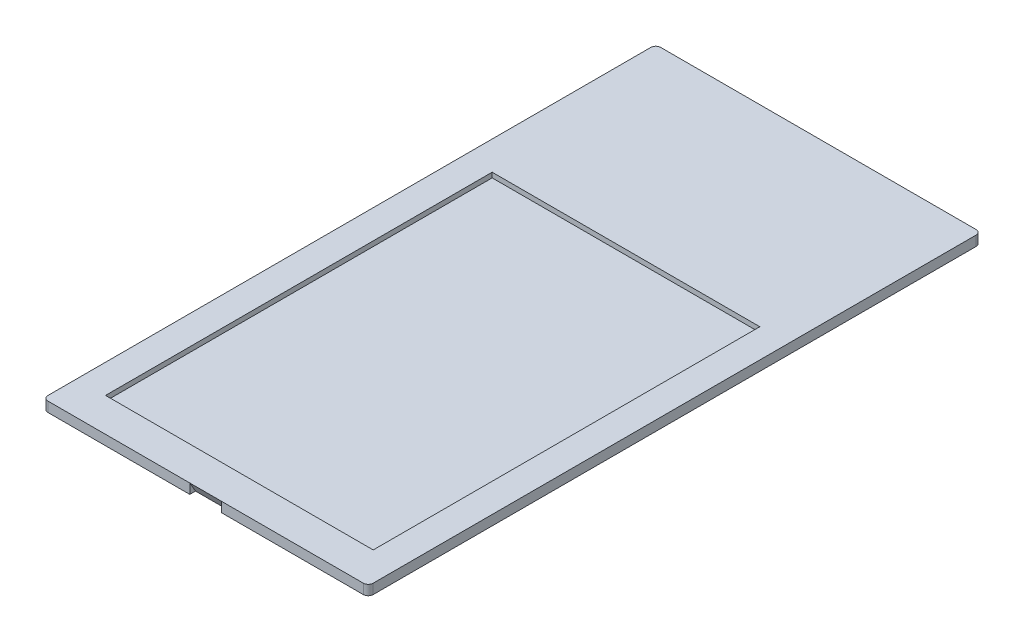
ISO-10303-21;
HEADER;
FILE_DESCRIPTION(('STEP AP214'),'2;1');
FILE_NAME('part.step','',(''),(''),'','','');
FILE_SCHEMA(('AUTOMOTIVE_DESIGN { 1 0 10303 214 1 1 1 1 }'));
ENDSEC;
DATA;
#1=APPLICATION_CONTEXT('core data for automotive mechanical design processes');
#2=APPLICATION_PROTOCOL_DEFINITION('international standard','automotive_design',2000,#1);
#3=PRODUCT_CONTEXT('',#1,'mechanical');
#4=PRODUCT('Part','Part','',(#3));
#5=PRODUCT_RELATED_PRODUCT_CATEGORY('part','',(#4));
#6=PRODUCT_DEFINITION_FORMATION('','',#4);
#7=PRODUCT_DEFINITION_CONTEXT('part definition',#1,'design');
#8=PRODUCT_DEFINITION('design','',#6,#7);
#9=PRODUCT_DEFINITION_SHAPE('','',#8);
#10=(LENGTH_UNIT() NAMED_UNIT(*) SI_UNIT(.MILLI.,.METRE.));
#11=(NAMED_UNIT(*) PLANE_ANGLE_UNIT() SI_UNIT($,.RADIAN.));
#12=(NAMED_UNIT(*) SI_UNIT($,.STERADIAN.) SOLID_ANGLE_UNIT());
#13=UNCERTAINTY_MEASURE_WITH_UNIT(LENGTH_MEASURE(1.E-05),#10,'distance_accuracy_value','');
#14=(GEOMETRIC_REPRESENTATION_CONTEXT(3) GLOBAL_UNCERTAINTY_ASSIGNED_CONTEXT((#13)) GLOBAL_UNIT_ASSIGNED_CONTEXT((#10,
#11,#12)) REPRESENTATION_CONTEXT('',''));
#15=CARTESIAN_POINT('',(0.,0.,0.));
#16=DIRECTION('',(0.,0.,1.));
#17=DIRECTION('',(1.,0.,0.));
#18=AXIS2_PLACEMENT_3D('',#15,#16,#17);
#19=CARTESIAN_POINT('',(0.,-2.,0.));
#20=DIRECTION('',(0.,-1.,0.));
#21=DIRECTION('',(0.,0.,-1.));
#22=AXIS2_PLACEMENT_3D('',#19,#20,#21);
#23=PLANE('',#22);
#24=DIRECTION('',(0.,0.,1.));
#25=VECTOR('',#24,1.);
#26=CARTESIAN_POINT('',(-32.8,-2.,2.19999999999999));
#27=LINE('',#26,#25);
#28=CARTESIAN_POINT('',(-32.8,-2.,3.19999999999999));
#29=VERTEX_POINT('',#28);
#30=CARTESIAN_POINT('',(-32.8,-2.,124.8));
#31=VERTEX_POINT('',#30);
#32=EDGE_CURVE('E268',#29,#31,#27,.T.);
#33=ORIENTED_EDGE('',*,*,#32,.F.);
#34=CARTESIAN_POINT('',(-31.8,-2.,3.19999999999999));
#35=DIRECTION('',(0.,-1.,0.));
#36=DIRECTION('',(0.,0.,-1.));
#37=AXIS2_PLACEMENT_3D('',#34,#35,#36);
#38=CIRCLE('',#37,1.);
#39=CARTESIAN_POINT('',(-31.8,-2.,2.19999999999999));
#40=VERTEX_POINT('',#39);
#41=EDGE_CURVE('E295',#29,#40,#38,.T.);
#42=ORIENTED_EDGE('',*,*,#41,.T.);
#43=DIRECTION('',(-1.,0.,0.));
#44=VECTOR('',#43,1.);
#45=CARTESIAN_POINT('',(-32.8,-2.,2.19999999999999));
#46=LINE('',#45,#44);
#47=CARTESIAN_POINT('',(-3.2,-2.,2.19999999999999));
#48=VERTEX_POINT('',#47);
#49=EDGE_CURVE('E274',#48,#40,#46,.T.);
#50=ORIENTED_EDGE('',*,*,#49,.F.);
#51=DIRECTION('',(0.,0.,-1.));
#52=VECTOR('',#51,1.);
#53=CARTESIAN_POINT('',(-3.2,-2.,2.19999999999999));
#54=LINE('',#53,#52);
#55=CARTESIAN_POINT('',(-3.2,-2.,3.35470053837923));
#56=VERTEX_POINT('',#55);
#57=EDGE_CURVE('E249',#56,#48,#54,.T.);
#58=ORIENTED_EDGE('',*,*,#57,.F.);
#59=DIRECTION('',(1.,0.,0.));
#60=VECTOR('',#59,1.);
#61=CARTESIAN_POINT('',(-3.2,-2.,3.35470053837923));
#62=LINE('',#61,#60);
#63=CARTESIAN_POINT('',(3.2,-2.,3.35470053837923));
#64=VERTEX_POINT('',#63);
#65=EDGE_CURVE('E232',#56,#64,#62,.T.);
#66=ORIENTED_EDGE('',*,*,#65,.T.);
#67=DIRECTION('',(0.,0.,-1.));
#68=VECTOR('',#67,1.);
#69=CARTESIAN_POINT('',(3.2,-2.,2.19999999999999));
#70=LINE('',#69,#68);
#71=CARTESIAN_POINT('',(3.2,-2.,2.19999999999999));
#72=VERTEX_POINT('',#71);
#73=EDGE_CURVE('E241',#64,#72,#70,.T.);
#74=ORIENTED_EDGE('',*,*,#73,.T.);
#75=CARTESIAN_POINT('',(31.8,-2.,2.19999999999999));
#76=VERTEX_POINT('',#75);
#77=EDGE_CURVE('E272',#76,#72,#46,.T.);
#78=ORIENTED_EDGE('',*,*,#77,.F.);
#79=CARTESIAN_POINT('',(31.8,-2.,3.19999999999999));
#80=DIRECTION('',(0.,-1.,0.));
#81=DIRECTION('',(0.,0.,-1.));
#82=AXIS2_PLACEMENT_3D('',#79,#80,#81);
#83=CIRCLE('',#82,1.);
#84=CARTESIAN_POINT('',(32.8,-2.,3.19999999999999));
#85=VERTEX_POINT('',#84);
#86=EDGE_CURVE('E60',#76,#85,#83,.T.);
#87=ORIENTED_EDGE('',*,*,#86,.T.);
#88=DIRECTION('',(0.,0.,-1.));
#89=VECTOR('',#88,1.);
#90=CARTESIAN_POINT('',(32.8,-2.,2.19999999999999));
#91=LINE('',#90,#89);
#92=CARTESIAN_POINT('',(32.8,-2.,124.8));
#93=VERTEX_POINT('',#92);
#94=EDGE_CURVE('E267',#93,#85,#91,.T.);
#95=ORIENTED_EDGE('',*,*,#94,.F.);
#96=CARTESIAN_POINT('',(31.8,-2.,124.8));
#97=DIRECTION('',(0.,-1.,0.));
#98=DIRECTION('',(0.,0.,-1.));
#99=AXIS2_PLACEMENT_3D('',#96,#97,#98);
#100=CIRCLE('',#99,1.);
#101=CARTESIAN_POINT('',(31.8,-2.,125.8));
#102=VERTEX_POINT('',#101);
#103=EDGE_CURVE('E54',#93,#102,#100,.T.);
#104=ORIENTED_EDGE('',*,*,#103,.T.);
#105=DIRECTION('',(1.,0.,0.));
#106=VECTOR('',#105,1.);
#107=CARTESIAN_POINT('',(-32.8,-2.,125.8));
#108=LINE('',#107,#106);
#109=CARTESIAN_POINT('',(3.2,-2.,125.8));
#110=VERTEX_POINT('',#109);
#111=EDGE_CURVE('E255',#110,#102,#108,.T.);
#112=ORIENTED_EDGE('',*,*,#111,.F.);
#113=DIRECTION('',(0.,0.,-1.));
#114=VECTOR('',#113,1.);
#115=CARTESIAN_POINT('',(3.2,-2.,124.645299461621));
#116=LINE('',#115,#114);
#117=CARTESIAN_POINT('',(3.2,-2.,124.645299461621));
#118=VERTEX_POINT('',#117);
#119=EDGE_CURVE('E221',#110,#118,#116,.T.);
#120=ORIENTED_EDGE('',*,*,#119,.T.);
#121=DIRECTION('',(1.,0.,0.));
#122=VECTOR('',#121,1.);
#123=CARTESIAN_POINT('',(-3.2,-2.,124.645299461621));
#124=LINE('',#123,#122);
#125=CARTESIAN_POINT('',(-3.2,-2.,124.645299461621));
#126=VERTEX_POINT('',#125);
#127=EDGE_CURVE('E217',#126,#118,#124,.T.);
#128=ORIENTED_EDGE('',*,*,#127,.F.);
#129=DIRECTION('',(0.,0.,-1.));
#130=VECTOR('',#129,1.);
#131=CARTESIAN_POINT('',(-3.2,-2.,124.645299461621));
#132=LINE('',#131,#130);
#133=CARTESIAN_POINT('',(-3.2,-2.,125.8));
#134=VERTEX_POINT('',#133);
#135=EDGE_CURVE('E211',#134,#126,#132,.T.);
#136=ORIENTED_EDGE('',*,*,#135,.F.);
#137=CARTESIAN_POINT('',(-31.8,-2.,125.8));
#138=VERTEX_POINT('',#137);
#139=EDGE_CURVE('E265',#138,#134,#108,.T.);
#140=ORIENTED_EDGE('',*,*,#139,.F.);
#141=CARTESIAN_POINT('',(-31.8,-2.,124.8));
#142=DIRECTION('',(0.,-1.,0.));
#143=DIRECTION('',(0.,0.,-1.));
#144=AXIS2_PLACEMENT_3D('',#141,#142,#143);
#145=CIRCLE('',#144,1.);
#146=EDGE_CURVE('E293',#138,#31,#145,.T.);
#147=ORIENTED_EDGE('',*,*,#146,.T.);
#148=EDGE_LOOP('',(#33,#42,#50,#58,#66,#74,#78,#87,#95,#104,#112,#120,#128,#136,#140,#147));
#149=FACE_BOUND('',#148,.T.);
#150=ADVANCED_FACE('F39',(#149),#23,.T.);
#151=CARTESIAN_POINT('',(-32.8,-141.929696633702,125.8));
#152=DIRECTION('',(0.,0.,1.));
#153=DIRECTION('',(1.,0.,0.));
#154=AXIS2_PLACEMENT_3D('',#151,#152,#153);
#155=PLANE('',#154);
#156=DIRECTION('',(1.,0.,0.));
#157=VECTOR('',#156,1.);
#158=CARTESIAN_POINT('',(-32.8,0.,125.8));
#159=LINE('',#158,#157);
#160=CARTESIAN_POINT('',(-31.8,0.,125.8));
#161=VERTEX_POINT('',#160);
#162=CARTESIAN_POINT('',(-3.2,0.,125.8));
#163=VERTEX_POINT('',#162);
#164=EDGE_CURVE('E260',#161,#163,#159,.T.);
#165=ORIENTED_EDGE('',*,*,#164,.F.);
#166=DIRECTION('',(0.,1.,0.));
#167=VECTOR('',#166,1.);
#168=CARTESIAN_POINT('',(-31.8,-141.929696633702,125.8));
#169=LINE('',#168,#167);
#170=EDGE_CURVE('E297',#161,#138,#169,.F.);
#171=ORIENTED_EDGE('',*,*,#170,.T.);
#172=ORIENTED_EDGE('',*,*,#139,.T.);
#173=DIRECTION('',(0.,-1.,0.));
#174=VECTOR('',#173,1.);
#175=CARTESIAN_POINT('',(-3.2,-2.,125.8));
#176=LINE('',#175,#174);
#177=EDGE_CURVE('E208',#163,#134,#176,.T.);
#178=ORIENTED_EDGE('',*,*,#177,.F.);
#179=EDGE_LOOP('',(#165,#171,#172,#178));
#180=FACE_BOUND('',#179,.T.);
#181=ADVANCED_FACE('F332',(#180),#155,.T.);
#182=CARTESIAN_POINT('',(-32.8,-141.929696633702,2.19999999999999));
#183=DIRECTION('',(0.,0.,-1.));
#184=DIRECTION('',(-1.,0.,0.));
#185=AXIS2_PLACEMENT_3D('',#182,#183,#184);
#186=PLANE('',#185);
#187=ORIENTED_EDGE('',*,*,#49,.T.);
#188=DIRECTION('',(0.,1.,0.));
#189=VECTOR('',#188,1.);
#190=CARTESIAN_POINT('',(-31.8,-141.929696633702,2.19999999999999));
#191=LINE('',#190,#189);
#192=CARTESIAN_POINT('',(-31.8,0.,2.19999999999999));
#193=VERTEX_POINT('',#192);
#194=EDGE_CURVE('E271',#40,#193,#191,.T.);
#195=ORIENTED_EDGE('',*,*,#194,.T.);
#196=DIRECTION('',(-1.,0.,0.));
#197=VECTOR('',#196,1.);
#198=CARTESIAN_POINT('',(-32.8,0.,2.19999999999999));
#199=LINE('',#198,#197);
#200=CARTESIAN_POINT('',(-3.2,0.,2.19999999999999));
#201=VERTEX_POINT('',#200);
#202=EDGE_CURVE('E256',#201,#193,#199,.T.);
#203=ORIENTED_EDGE('',*,*,#202,.F.);
#204=DIRECTION('',(0.,1.,0.));
#205=VECTOR('',#204,1.);
#206=CARTESIAN_POINT('',(-3.2,0.,2.19999999999999));
#207=LINE('',#206,#205);
#208=EDGE_CURVE('E235',#48,#201,#207,.T.);
#209=ORIENTED_EDGE('',*,*,#208,.F.);
#210=EDGE_LOOP('',(#187,#195,#203,#209));
#211=FACE_BOUND('',#210,.T.);
#212=ADVANCED_FACE('F351',(#211),#186,.T.);
#213=CARTESIAN_POINT('',(0.,0.,0.));
#214=DIRECTION('',(0.,1.,0.));
#215=DIRECTION('',(0.,0.,1.));
#216=AXIS2_PLACEMENT_3D('',#213,#214,#215);
#217=PLANE('',#216);
#218=DIRECTION('',(0.,0.,1.));
#219=VECTOR('',#218,1.);
#220=CARTESIAN_POINT('',(-27.,0.,41.));
#221=LINE('',#220,#219);
#222=CARTESIAN_POINT('',(-27.,0.,41.));
#223=VERTEX_POINT('',#222);
#224=CARTESIAN_POINT('',(-27.,0.,119.));
#225=VERTEX_POINT('',#224);
#226=EDGE_CURVE('E172',#223,#225,#221,.T.);
#227=ORIENTED_EDGE('',*,*,#226,.F.);
#228=DIRECTION('',(-1.,0.,0.));
#229=VECTOR('',#228,1.);
#230=CARTESIAN_POINT('',(-27.,0.,41.));
#231=LINE('',#230,#229);
#232=CARTESIAN_POINT('',(27.,0.,41.));
#233=VERTEX_POINT('',#232);
#234=EDGE_CURVE('E189',#233,#223,#231,.T.);
#235=ORIENTED_EDGE('',*,*,#234,.F.);
#236=DIRECTION('',(0.,0.,-1.));
#237=VECTOR('',#236,1.);
#238=CARTESIAN_POINT('',(27.,0.,41.));
#239=LINE('',#238,#237);
#240=CARTESIAN_POINT('',(27.,0.,119.));
#241=VERTEX_POINT('',#240);
#242=EDGE_CURVE('E192',#241,#233,#239,.T.);
#243=ORIENTED_EDGE('',*,*,#242,.F.);
#244=DIRECTION('',(1.,0.,0.));
#245=VECTOR('',#244,1.);
#246=CARTESIAN_POINT('',(-27.,0.,119.));
#247=LINE('',#246,#245);
#248=EDGE_CURVE('E198',#225,#241,#247,.T.);
#249=ORIENTED_EDGE('',*,*,#248,.F.);
#250=EDGE_LOOP('',(#227,#235,#243,#249));
#251=FACE_BOUND('',#250,.T.);
#252=ORIENTED_EDGE('',*,*,#202,.T.);
#253=CARTESIAN_POINT('',(-31.8,0.,3.19999999999999));
#254=DIRECTION('',(0.,1.,0.));
#255=DIRECTION('',(0.,0.,1.));
#256=AXIS2_PLACEMENT_3D('',#253,#254,#255);
#257=CIRCLE('',#256,1.);
#258=CARTESIAN_POINT('',(-32.8,0.,3.19999999999999));
#259=VERTEX_POINT('',#258);
#260=EDGE_CURVE('E284',#193,#259,#257,.T.);
#261=ORIENTED_EDGE('',*,*,#260,.T.);
#262=DIRECTION('',(0.,0.,1.));
#263=VECTOR('',#262,1.);
#264=CARTESIAN_POINT('',(-32.8,0.,2.19999999999999));
#265=LINE('',#264,#263);
#266=CARTESIAN_POINT('',(-32.8,0.,124.8));
#267=VERTEX_POINT('',#266);
#268=EDGE_CURVE('E230',#259,#267,#265,.T.);
#269=ORIENTED_EDGE('',*,*,#268,.T.);
#270=CARTESIAN_POINT('',(-31.8,0.,124.8));
#271=DIRECTION('',(0.,1.,0.));
#272=DIRECTION('',(0.,0.,1.));
#273=AXIS2_PLACEMENT_3D('',#270,#271,#272);
#274=CIRCLE('',#273,1.);
#275=EDGE_CURVE('E282',#267,#161,#274,.T.);
#276=ORIENTED_EDGE('',*,*,#275,.T.);
#277=ORIENTED_EDGE('',*,*,#164,.T.);
#278=DIRECTION('',(1.,0.,0.));
#279=VECTOR('',#278,1.);
#280=CARTESIAN_POINT('',(-3.2,0.,125.8));
#281=LINE('',#280,#279);
#282=CARTESIAN_POINT('',(3.2,0.,125.8));
#283=VERTEX_POINT('',#282);
#284=EDGE_CURVE('E227',#163,#283,#281,.T.);
#285=ORIENTED_EDGE('',*,*,#284,.T.);
#286=CARTESIAN_POINT('',(31.8,0.,125.8));
#287=VERTEX_POINT('',#286);
#288=EDGE_CURVE('E262',#283,#287,#159,.T.);
#289=ORIENTED_EDGE('',*,*,#288,.T.);
#290=CARTESIAN_POINT('',(31.8,0.,124.8));
#291=DIRECTION('',(0.,1.,0.));
#292=DIRECTION('',(0.,0.,1.));
#293=AXIS2_PLACEMENT_3D('',#290,#291,#292);
#294=CIRCLE('',#293,1.);
#295=CARTESIAN_POINT('',(32.8,0.,124.8));
#296=VERTEX_POINT('',#295);
#297=EDGE_CURVE('E280',#287,#296,#294,.T.);
#298=ORIENTED_EDGE('',*,*,#297,.T.);
#299=DIRECTION('',(0.,0.,-1.));
#300=VECTOR('',#299,1.);
#301=CARTESIAN_POINT('',(32.8,0.,2.19999999999999));
#302=LINE('',#301,#300);
#303=CARTESIAN_POINT('',(32.8,0.,3.19999999999999));
#304=VERTEX_POINT('',#303);
#305=EDGE_CURVE('E257',#296,#304,#302,.T.);
#306=ORIENTED_EDGE('',*,*,#305,.T.);
#307=CARTESIAN_POINT('',(31.8,0.,3.19999999999999));
#308=DIRECTION('',(0.,1.,0.));
#309=DIRECTION('',(0.,0.,1.));
#310=AXIS2_PLACEMENT_3D('',#307,#308,#309);
#311=CIRCLE('',#310,1.);
#312=CARTESIAN_POINT('',(31.8,0.,2.19999999999999));
#313=VERTEX_POINT('',#312);
#314=EDGE_CURVE('E278',#304,#313,#311,.T.);
#315=ORIENTED_EDGE('',*,*,#314,.T.);
#316=CARTESIAN_POINT('',(3.2,0.,2.19999999999999));
#317=VERTEX_POINT('',#316);
#318=EDGE_CURVE('E253',#313,#317,#199,.T.);
#319=ORIENTED_EDGE('',*,*,#318,.T.);
#320=DIRECTION('',(1.,0.,0.));
#321=VECTOR('',#320,1.);
#322=CARTESIAN_POINT('',(-3.2,0.,2.19999999999999));
#323=LINE('',#322,#321);
#324=EDGE_CURVE('E204',#201,#317,#323,.T.);
#325=ORIENTED_EDGE('',*,*,#324,.F.);
#326=EDGE_LOOP('',(#252,#261,#269,#276,#277,#285,#289,#298,#306,#315,#319,#325));
#327=FACE_BOUND('',#326,.T.);
#328=ADVANCED_FACE('F319',(#251,#327),#217,.T.);
#329=ORIENTED_EDGE('',*,*,#111,.T.);
#330=DIRECTION('',(0.,1.,0.));
#331=VECTOR('',#330,1.);
#332=CARTESIAN_POINT('',(31.8,-141.929696633702,125.8));
#333=LINE('',#332,#331);
#334=EDGE_CURVE('E299',#102,#287,#333,.T.);
#335=ORIENTED_EDGE('',*,*,#334,.T.);
#336=ORIENTED_EDGE('',*,*,#288,.F.);
#337=DIRECTION('',(0.,-1.,0.));
#338=VECTOR('',#337,1.);
#339=CARTESIAN_POINT('',(3.2,-2.,125.8));
#340=LINE('',#339,#338);
#341=EDGE_CURVE('E218',#283,#110,#340,.T.);
#342=ORIENTED_EDGE('',*,*,#341,.T.);
#343=EDGE_LOOP('',(#329,#335,#336,#342));
#344=FACE_BOUND('',#343,.T.);
#345=ADVANCED_FACE('F316',(#344),#155,.T.);
#346=CARTESIAN_POINT('',(32.8,-141.929696633702,2.19999999999999));
#347=DIRECTION('',(1.,0.,0.));
#348=DIRECTION('',(0.,0.,-1.));
#349=AXIS2_PLACEMENT_3D('',#346,#347,#348);
#350=PLANE('',#349);
#351=ORIENTED_EDGE('',*,*,#305,.F.);
#352=DIRECTION('',(0.,1.,0.));
#353=VECTOR('',#352,1.);
#354=CARTESIAN_POINT('',(32.8,-141.929696633702,124.8));
#355=LINE('',#354,#353);
#356=EDGE_CURVE('E47',#296,#93,#355,.F.);
#357=ORIENTED_EDGE('',*,*,#356,.T.);
#358=ORIENTED_EDGE('',*,*,#94,.T.);
#359=DIRECTION('',(0.,1.,0.));
#360=VECTOR('',#359,1.);
#361=CARTESIAN_POINT('',(32.8,-141.929696633702,3.19999999999999));
#362=LINE('',#361,#360);
#363=EDGE_CURVE('E302',#85,#304,#362,.T.);
#364=ORIENTED_EDGE('',*,*,#363,.T.);
#365=EDGE_LOOP('',(#351,#357,#358,#364));
#366=FACE_BOUND('',#365,.T.);
#367=ADVANCED_FACE('F307',(#366),#350,.T.);
#368=ORIENTED_EDGE('',*,*,#318,.F.);
#369=DIRECTION('',(0.,1.,0.));
#370=VECTOR('',#369,1.);
#371=CARTESIAN_POINT('',(31.8,-141.929696633702,2.19999999999999));
#372=LINE('',#371,#370);
#373=EDGE_CURVE('E11',#313,#76,#372,.F.);
#374=ORIENTED_EDGE('',*,*,#373,.T.);
#375=ORIENTED_EDGE('',*,*,#77,.T.);
#376=DIRECTION('',(0.,1.,0.));
#377=VECTOR('',#376,1.);
#378=CARTESIAN_POINT('',(3.2,0.,2.19999999999999));
#379=LINE('',#378,#377);
#380=EDGE_CURVE('E238',#72,#317,#379,.T.);
#381=ORIENTED_EDGE('',*,*,#380,.T.);
#382=EDGE_LOOP('',(#368,#374,#375,#381));
#383=FACE_BOUND('',#382,.T.);
#384=ADVANCED_FACE('F367',(#383),#186,.T.);
#385=CARTESIAN_POINT('',(-32.8,-141.929696633702,2.19999999999999));
#386=DIRECTION('',(-1.,0.,0.));
#387=DIRECTION('',(0.,0.,1.));
#388=AXIS2_PLACEMENT_3D('',#385,#386,#387);
#389=PLANE('',#388);
#390=ORIENTED_EDGE('',*,*,#268,.F.);
#391=DIRECTION('',(0.,1.,0.));
#392=VECTOR('',#391,1.);
#393=CARTESIAN_POINT('',(-32.8,-141.929696633702,3.19999999999999));
#394=LINE('',#393,#392);
#395=EDGE_CURVE('E289',#259,#29,#394,.F.);
#396=ORIENTED_EDGE('',*,*,#395,.T.);
#397=ORIENTED_EDGE('',*,*,#32,.T.);
#398=DIRECTION('',(0.,1.,0.));
#399=VECTOR('',#398,1.);
#400=CARTESIAN_POINT('',(-32.8,-141.929696633702,124.8));
#401=LINE('',#400,#399);
#402=EDGE_CURVE('E286',#31,#267,#401,.T.);
#403=ORIENTED_EDGE('',*,*,#402,.T.);
#404=EDGE_LOOP('',(#390,#396,#397,#403));
#405=FACE_BOUND('',#404,.T.);
#406=ADVANCED_FACE('F341',(#405),#389,.T.);
#407=CARTESIAN_POINT('',(-3.2,-2.,3.35470053837923));
#408=DIRECTION('',(0.,0.499999999999995,0.866025403784441));
#409=DIRECTION('',(0.,-0.866025403784441,0.499999999999996));
#410=AXIS2_PLACEMENT_3D('',#407,#408,#409);
#411=PLANE('',#410);
#412=DIRECTION('',(0.,-0.866025403784441,0.499999999999996));
#413=VECTOR('',#412,1.);
#414=CARTESIAN_POINT('',(3.2,-2.,3.35470053837923));
#415=LINE('',#414,#413);
#416=EDGE_CURVE('E222',#317,#64,#415,.T.);
#417=ORIENTED_EDGE('',*,*,#416,.T.);
#418=ORIENTED_EDGE('',*,*,#65,.F.);
#419=DIRECTION('',(0.,-0.866025403784441,0.499999999999996));
#420=VECTOR('',#419,1.);
#421=CARTESIAN_POINT('',(-3.2,-2.,3.35470053837923));
#422=LINE('',#421,#420);
#423=EDGE_CURVE('E242',#201,#56,#422,.T.);
#424=ORIENTED_EDGE('',*,*,#423,.F.);
#425=ORIENTED_EDGE('',*,*,#324,.T.);
#426=EDGE_LOOP('',(#417,#418,#424,#425));
#427=FACE_BOUND('',#426,.T.);
#428=ADVANCED_FACE('F358',(#427),#411,.F.);
#429=CARTESIAN_POINT('',(-3.2,0.,0.));
#430=DIRECTION('',(1.,0.,0.));
#431=DIRECTION('',(0.,0.,-1.));
#432=AXIS2_PLACEMENT_3D('',#429,#430,#431);
#433=PLANE('',#432);
#434=ORIENTED_EDGE('',*,*,#423,.T.);
#435=ORIENTED_EDGE('',*,*,#57,.T.);
#436=ORIENTED_EDGE('',*,*,#208,.T.);
#437=EDGE_LOOP('',(#434,#435,#436));
#438=FACE_BOUND('',#437,.T.);
#439=ADVANCED_FACE('F356',(#438),#433,.T.);
#440=CARTESIAN_POINT('',(3.2,0.,0.));
#441=DIRECTION('',(1.,0.,0.));
#442=DIRECTION('',(0.,0.,-1.));
#443=AXIS2_PLACEMENT_3D('',#440,#441,#442);
#444=PLANE('',#443);
#445=ORIENTED_EDGE('',*,*,#416,.F.);
#446=ORIENTED_EDGE('',*,*,#380,.F.);
#447=ORIENTED_EDGE('',*,*,#73,.F.);
#448=EDGE_LOOP('',(#445,#446,#447));
#449=FACE_BOUND('',#448,.T.);
#450=ADVANCED_FACE('F362',(#449),#444,.F.);
#451=CARTESIAN_POINT('',(-3.2,0.,125.8));
#452=DIRECTION('',(0.,0.499999999999995,-0.866025403784441));
#453=DIRECTION('',(0.,0.866025403784441,0.499999999999996));
#454=AXIS2_PLACEMENT_3D('',#451,#452,#453);
#455=PLANE('',#454);
#456=DIRECTION('',(0.,0.866025403784441,0.499999999999996));
#457=VECTOR('',#456,1.);
#458=CARTESIAN_POINT('',(3.2,0.,125.8));
#459=LINE('',#458,#457);
#460=EDGE_CURVE('E212',#118,#283,#459,.T.);
#461=ORIENTED_EDGE('',*,*,#460,.T.);
#462=ORIENTED_EDGE('',*,*,#284,.F.);
#463=DIRECTION('',(0.,0.866025403784441,0.499999999999996));
#464=VECTOR('',#463,1.);
#465=CARTESIAN_POINT('',(-3.2,0.,125.8));
#466=LINE('',#465,#464);
#467=EDGE_CURVE('E214',#126,#163,#466,.T.);
#468=ORIENTED_EDGE('',*,*,#467,.F.);
#469=ORIENTED_EDGE('',*,*,#127,.T.);
#470=EDGE_LOOP('',(#461,#462,#468,#469));
#471=FACE_BOUND('',#470,.T.);
#472=ADVANCED_FACE('F324',(#471),#455,.F.);
#473=CARTESIAN_POINT('',(-3.2,0.,0.));
#474=DIRECTION('',(1.,0.,0.));
#475=DIRECTION('',(0.,0.,-1.));
#476=AXIS2_PLACEMENT_3D('',#473,#474,#475);
#477=PLANE('',#476);
#478=ORIENTED_EDGE('',*,*,#177,.T.);
#479=ORIENTED_EDGE('',*,*,#135,.T.);
#480=ORIENTED_EDGE('',*,*,#467,.T.);
#481=EDGE_LOOP('',(#478,#479,#480));
#482=FACE_BOUND('',#481,.T.);
#483=ADVANCED_FACE('F329',(#482),#477,.T.);
#484=CARTESIAN_POINT('',(3.2,0.,0.));
#485=DIRECTION('',(1.,0.,0.));
#486=DIRECTION('',(0.,0.,-1.));
#487=AXIS2_PLACEMENT_3D('',#484,#485,#486);
#488=PLANE('',#487);
#489=ORIENTED_EDGE('',*,*,#341,.F.);
#490=ORIENTED_EDGE('',*,*,#460,.F.);
#491=ORIENTED_EDGE('',*,*,#119,.F.);
#492=EDGE_LOOP('',(#489,#490,#491));
#493=FACE_BOUND('',#492,.T.);
#494=ADVANCED_FACE('F520',(#493),#488,.F.);
#495=CARTESIAN_POINT('',(-27.,-1.,41.));
#496=DIRECTION('',(-1.,0.,0.));
#497=DIRECTION('',(0.,0.,1.));
#498=AXIS2_PLACEMENT_3D('',#495,#496,#497);
#499=PLANE('',#498);
#500=ORIENTED_EDGE('',*,*,#226,.T.);
#501=DIRECTION('',(0.,1.,0.));
#502=VECTOR('',#501,1.);
#503=CARTESIAN_POINT('',(-27.,-1.,119.));
#504=LINE('',#503,#502);
#505=CARTESIAN_POINT('',(-27.,-1.,119.));
#506=VERTEX_POINT('',#505);
#507=EDGE_CURVE('E165',#506,#225,#504,.T.);
#508=ORIENTED_EDGE('',*,*,#507,.F.);
#509=DIRECTION('',(0.,0.,1.));
#510=VECTOR('',#509,1.);
#511=CARTESIAN_POINT('',(-27.,-1.,41.));
#512=LINE('',#511,#510);
#513=CARTESIAN_POINT('',(-27.,-1.,41.));
#514=VERTEX_POINT('',#513);
#515=EDGE_CURVE('E169',#514,#506,#512,.T.);
#516=ORIENTED_EDGE('',*,*,#515,.F.);
#517=DIRECTION('',(0.,1.,0.));
#518=VECTOR('',#517,1.);
#519=CARTESIAN_POINT('',(-27.,-1.,41.));
#520=LINE('',#519,#518);
#521=EDGE_CURVE('E202',#514,#223,#520,.T.);
#522=ORIENTED_EDGE('',*,*,#521,.T.);
#523=EDGE_LOOP('',(#500,#508,#516,#522));
#524=FACE_BOUND('',#523,.T.);
#525=ADVANCED_FACE('F167',(#524),#499,.F.);
#526=CARTESIAN_POINT('',(-27.,-1.,41.));
#527=DIRECTION('',(0.,0.,-1.));
#528=DIRECTION('',(-1.,0.,0.));
#529=AXIS2_PLACEMENT_3D('',#526,#527,#528);
#530=PLANE('',#529);
#531=ORIENTED_EDGE('',*,*,#234,.T.);
#532=ORIENTED_EDGE('',*,*,#521,.F.);
#533=DIRECTION('',(-1.,0.,0.));
#534=VECTOR('',#533,1.);
#535=CARTESIAN_POINT('',(-27.,-1.,41.));
#536=LINE('',#535,#534);
#537=CARTESIAN_POINT('',(27.,-1.,41.));
#538=VERTEX_POINT('',#537);
#539=EDGE_CURVE('E177',#538,#514,#536,.T.);
#540=ORIENTED_EDGE('',*,*,#539,.F.);
#541=DIRECTION('',(0.,1.,0.));
#542=VECTOR('',#541,1.);
#543=CARTESIAN_POINT('',(27.,-1.,41.));
#544=LINE('',#543,#542);
#545=EDGE_CURVE('E205',#538,#233,#544,.T.);
#546=ORIENTED_EDGE('',*,*,#545,.T.);
#547=EDGE_LOOP('',(#531,#532,#540,#546));
#548=FACE_BOUND('',#547,.T.);
#549=ADVANCED_FACE('F499',(#548),#530,.F.);
#550=CARTESIAN_POINT('',(27.,-1.,41.));
#551=DIRECTION('',(1.,0.,0.));
#552=DIRECTION('',(0.,0.,-1.));
#553=AXIS2_PLACEMENT_3D('',#550,#551,#552);
#554=PLANE('',#553);
#555=ORIENTED_EDGE('',*,*,#242,.T.);
#556=ORIENTED_EDGE('',*,*,#545,.F.);
#557=DIRECTION('',(0.,0.,-1.));
#558=VECTOR('',#557,1.);
#559=CARTESIAN_POINT('',(27.,-1.,41.));
#560=LINE('',#559,#558);
#561=CARTESIAN_POINT('',(27.,-1.,119.));
#562=VERTEX_POINT('',#561);
#563=EDGE_CURVE('E185',#562,#538,#560,.T.);
#564=ORIENTED_EDGE('',*,*,#563,.F.);
#565=DIRECTION('',(0.,1.,0.));
#566=VECTOR('',#565,1.);
#567=CARTESIAN_POINT('',(27.,-1.,119.));
#568=LINE('',#567,#566);
#569=EDGE_CURVE('E176',#562,#241,#568,.T.);
#570=ORIENTED_EDGE('',*,*,#569,.T.);
#571=EDGE_LOOP('',(#555,#556,#564,#570));
#572=FACE_BOUND('',#571,.T.);
#573=ADVANCED_FACE('F489',(#572),#554,.F.);
#574=CARTESIAN_POINT('',(-27.,-1.,119.));
#575=DIRECTION('',(0.,0.,1.));
#576=DIRECTION('',(1.,0.,0.));
#577=AXIS2_PLACEMENT_3D('',#574,#575,#576);
#578=PLANE('',#577);
#579=ORIENTED_EDGE('',*,*,#248,.T.);
#580=ORIENTED_EDGE('',*,*,#569,.F.);
#581=DIRECTION('',(1.,0.,0.));
#582=VECTOR('',#581,1.);
#583=CARTESIAN_POINT('',(-27.,-1.,119.));
#584=LINE('',#583,#582);
#585=EDGE_CURVE('E180',#506,#562,#584,.T.);
#586=ORIENTED_EDGE('',*,*,#585,.F.);
#587=ORIENTED_EDGE('',*,*,#507,.T.);
#588=EDGE_LOOP('',(#579,#580,#586,#587));
#589=FACE_BOUND('',#588,.T.);
#590=ADVANCED_FACE('F181',(#589),#578,.F.);
#591=CARTESIAN_POINT('',(0.,-1.,0.));
#592=DIRECTION('',(0.,1.,0.));
#593=DIRECTION('',(0.,0.,1.));
#594=AXIS2_PLACEMENT_3D('',#591,#592,#593);
#595=PLANE('',#594);
#596=ORIENTED_EDGE('',*,*,#515,.T.);
#597=ORIENTED_EDGE('',*,*,#585,.T.);
#598=ORIENTED_EDGE('',*,*,#563,.T.);
#599=ORIENTED_EDGE('',*,*,#539,.T.);
#600=EDGE_LOOP('',(#596,#597,#598,#599));
#601=FACE_BOUND('',#600,.T.);
#602=ADVANCED_FACE('F187',(#601),#595,.T.);
#603=CARTESIAN_POINT('',(-31.8,-141.929696633702,3.19999999999999));
#604=DIRECTION('',(0.,1.,0.));
#605=DIRECTION('',(0.,0.,1.));
#606=AXIS2_PLACEMENT_3D('',#603,#604,#605);
#607=CYLINDRICAL_SURFACE('',#606,1.);
#608=ORIENTED_EDGE('',*,*,#41,.F.);
#609=ORIENTED_EDGE('',*,*,#395,.F.);
#610=ORIENTED_EDGE('',*,*,#260,.F.);
#611=ORIENTED_EDGE('',*,*,#194,.F.);
#612=EDGE_LOOP('',(#608,#609,#610,#611));
#613=FACE_BOUND('',#612,.T.);
#614=ADVANCED_FACE('F348',(#613),#607,.T.);
#615=CARTESIAN_POINT('',(-31.8,-141.929696633702,124.8));
#616=DIRECTION('',(0.,1.,0.));
#617=DIRECTION('',(0.,0.,1.));
#618=AXIS2_PLACEMENT_3D('',#615,#616,#617);
#619=CYLINDRICAL_SURFACE('',#618,1.);
#620=ORIENTED_EDGE('',*,*,#146,.F.);
#621=ORIENTED_EDGE('',*,*,#170,.F.);
#622=ORIENTED_EDGE('',*,*,#275,.F.);
#623=ORIENTED_EDGE('',*,*,#402,.F.);
#624=EDGE_LOOP('',(#620,#621,#622,#623));
#625=FACE_BOUND('',#624,.T.);
#626=ADVANCED_FACE('F338',(#625),#619,.T.);
#627=CARTESIAN_POINT('',(31.8,-141.929696633702,124.8));
#628=DIRECTION('',(0.,1.,0.));
#629=DIRECTION('',(0.,0.,1.));
#630=AXIS2_PLACEMENT_3D('',#627,#628,#629);
#631=CYLINDRICAL_SURFACE('',#630,1.);
#632=ORIENTED_EDGE('',*,*,#103,.F.);
#633=ORIENTED_EDGE('',*,*,#356,.F.);
#634=ORIENTED_EDGE('',*,*,#297,.F.);
#635=ORIENTED_EDGE('',*,*,#334,.F.);
#636=EDGE_LOOP('',(#632,#633,#634,#635));
#637=FACE_BOUND('',#636,.T.);
#638=ADVANCED_FACE('F312',(#637),#631,.T.);
#639=CARTESIAN_POINT('',(31.8,-141.929696633702,3.19999999999999));
#640=DIRECTION('',(0.,1.,0.));
#641=DIRECTION('',(0.,0.,1.));
#642=AXIS2_PLACEMENT_3D('',#639,#640,#641);
#643=CYLINDRICAL_SURFACE('',#642,1.);
#644=ORIENTED_EDGE('',*,*,#86,.F.);
#645=ORIENTED_EDGE('',*,*,#373,.F.);
#646=ORIENTED_EDGE('',*,*,#314,.F.);
#647=ORIENTED_EDGE('',*,*,#363,.F.);
#648=EDGE_LOOP('',(#644,#645,#646,#647));
#649=FACE_BOUND('',#648,.T.);
#650=ADVANCED_FACE('F41',(#649),#643,.T.);
#651=CLOSED_SHELL('',(#150,#181,#212,#328,#345,#367,#384,#406,#428,#439,#450,#472,#483,#494,
#525,#549,#573,#590,#602,#614,#626,#638,#650));
#652=MANIFOLD_SOLID_BREP('B2',#651);
#653=ADVANCED_BREP_SHAPE_REPRESENTATION('',(#18,#652),#14);
#654=SHAPE_DEFINITION_REPRESENTATION(#9,#653);
ENDSEC;
END-ISO-10303-21;
